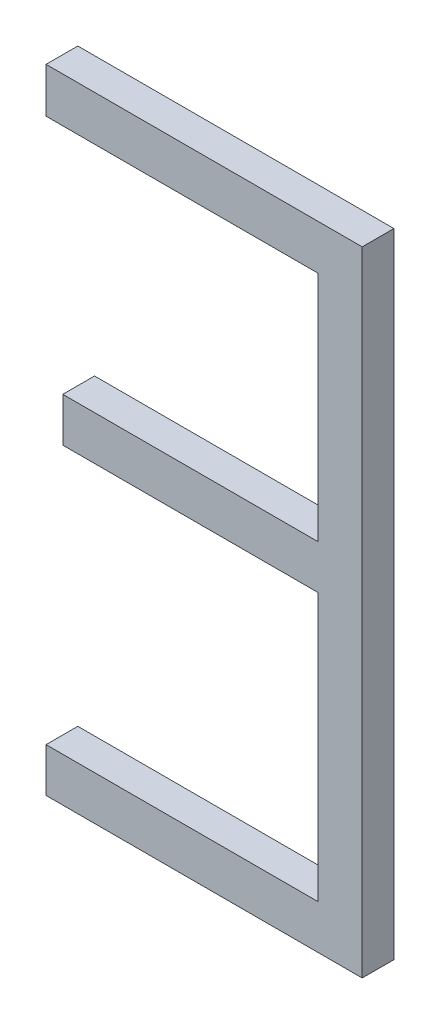
ISO-10303-21;
HEADER;
FILE_DESCRIPTION(('STEP AP214'),'2;1');
FILE_NAME('part.step','',(''),(''),'','','');
FILE_SCHEMA(('AUTOMOTIVE_DESIGN { 1 0 10303 214 1 1 1 1 }'));
ENDSEC;
DATA;
#1=APPLICATION_CONTEXT('core data for automotive mechanical design processes');
#2=APPLICATION_PROTOCOL_DEFINITION('international standard','automotive_design',2000,#1);
#3=PRODUCT_CONTEXT('',#1,'mechanical');
#4=PRODUCT('Part','Part','',(#3));
#5=PRODUCT_RELATED_PRODUCT_CATEGORY('part','',(#4));
#6=PRODUCT_DEFINITION_FORMATION('','',#4);
#7=PRODUCT_DEFINITION_CONTEXT('part definition',#1,'design');
#8=PRODUCT_DEFINITION('design','',#6,#7);
#9=PRODUCT_DEFINITION_SHAPE('','',#8);
#10=(LENGTH_UNIT() NAMED_UNIT(*) SI_UNIT(.MILLI.,.METRE.));
#11=(NAMED_UNIT(*) PLANE_ANGLE_UNIT() SI_UNIT($,.RADIAN.));
#12=(NAMED_UNIT(*) SI_UNIT($,.STERADIAN.) SOLID_ANGLE_UNIT());
#13=UNCERTAINTY_MEASURE_WITH_UNIT(LENGTH_MEASURE(1.E-05),#10,'distance_accuracy_value','');
#14=(GEOMETRIC_REPRESENTATION_CONTEXT(3) GLOBAL_UNCERTAINTY_ASSIGNED_CONTEXT((#13)) GLOBAL_UNIT_ASSIGNED_CONTEXT((#10,
#11,#12)) REPRESENTATION_CONTEXT('',''));
#15=CARTESIAN_POINT('',(0.,0.,0.));
#16=DIRECTION('',(0.,0.,1.));
#17=DIRECTION('',(1.,0.,0.));
#18=AXIS2_PLACEMENT_3D('',#15,#16,#17);
#19=CARTESIAN_POINT('',(68.6985059877903,65.7847250723611,-39.));
#20=DIRECTION('',(0.,0.,1.));
#21=DIRECTION('',(1.,0.,0.));
#22=AXIS2_PLACEMENT_3D('',#19,#20,#21);
#23=PLANE('',#22);
#24=DIRECTION('',(0.,1.,0.));
#25=VECTOR('',#24,1.);
#26=CARTESIAN_POINT('',(69.5556488448903,65.7847250723611,-39.));
#27=LINE('',#26,#25);
#28=CARTESIAN_POINT('',(69.5556488448903,66.7666945591811,-39.));
#29=VERTEX_POINT('',#28);
#30=CARTESIAN_POINT('',(69.5556488448903,65.9234213275611,-39.));
#31=VERTEX_POINT('',#30);
#32=EDGE_CURVE('E109',#29,#31,#27,.F.);
#33=ORIENTED_EDGE('',*,*,#32,.T.);
#34=DIRECTION('',(1.,0.,0.));
#35=VECTOR('',#34,1.);
#36=CARTESIAN_POINT('',(68.6985059877903,65.9234213275611,-39.));
#37=LINE('',#36,#35);
#38=CARTESIAN_POINT('',(68.6985059877903,65.9234213275611,-39.));
#39=VERTEX_POINT('',#38);
#40=EDGE_CURVE('E106',#31,#39,#37,.F.);
#41=ORIENTED_EDGE('',*,*,#40,.T.);
#42=DIRECTION('',(0.,1.,0.));
#43=VECTOR('',#42,1.);
#44=CARTESIAN_POINT('',(68.6985059877903,65.7847250723611,-39.));
#45=LINE('',#44,#43);
#46=CARTESIAN_POINT('',(68.6985059877903,65.7847250723611,-39.));
#47=VERTEX_POINT('',#46);
#48=EDGE_CURVE('E20',#39,#47,#45,.F.);
#49=ORIENTED_EDGE('',*,*,#48,.T.);
#50=DIRECTION('',(1.,0.,0.));
#51=VECTOR('',#50,1.);
#52=CARTESIAN_POINT('',(68.6985059877903,65.7847250723611,-39.));
#53=LINE('',#52,#51);
#54=CARTESIAN_POINT('',(69.6943451000903,65.7847250723611,-39.));
#55=VERTEX_POINT('',#54);
#56=EDGE_CURVE('E112',#47,#55,#53,.T.);
#57=ORIENTED_EDGE('',*,*,#56,.T.);
#58=DIRECTION('',(0.,1.,0.));
#59=VECTOR('',#58,1.);
#60=CARTESIAN_POINT('',(69.6943451000903,65.7847250723611,-39.));
#61=LINE('',#60,#59);
#62=CARTESIAN_POINT('',(69.6943451000903,67.7791772221511,-39.));
#63=VERTEX_POINT('',#62);
#64=EDGE_CURVE('E141',#55,#63,#61,.T.);
#65=ORIENTED_EDGE('',*,*,#64,.T.);
#66=DIRECTION('',(1.,0.,0.));
#67=VECTOR('',#66,1.);
#68=CARTESIAN_POINT('',(68.6985059877903,67.7791772221511,-39.));
#69=LINE('',#68,#67);
#70=CARTESIAN_POINT('',(68.6985059877903,67.7791772221511,-39.));
#71=VERTEX_POINT('',#70);
#72=EDGE_CURVE('E102',#63,#71,#69,.F.);
#73=ORIENTED_EDGE('',*,*,#72,.T.);
#74=DIRECTION('',(0.,1.,0.));
#75=VECTOR('',#74,1.);
#76=CARTESIAN_POINT('',(68.6985059877903,65.7847250723611,-39.));
#77=LINE('',#76,#75);
#78=CARTESIAN_POINT('',(68.6985059877903,67.6377070418411,-39.));
#79=VERTEX_POINT('',#78);
#80=EDGE_CURVE('E123',#71,#79,#77,.F.);
#81=ORIENTED_EDGE('',*,*,#80,.T.);
#82=DIRECTION('',(1.,0.,0.));
#83=VECTOR('',#82,1.);
#84=CARTESIAN_POINT('',(68.6985059877903,67.6377070418411,-39.));
#85=LINE('',#84,#83);
#86=CARTESIAN_POINT('',(69.5556488448903,67.6377070418411,-39.));
#87=VERTEX_POINT('',#86);
#88=EDGE_CURVE('E124',#79,#87,#85,.T.);
#89=ORIENTED_EDGE('',*,*,#88,.T.);
#90=DIRECTION('',(0.,1.,0.));
#91=VECTOR('',#90,1.);
#92=CARTESIAN_POINT('',(69.5556488448903,65.7847250723611,-39.));
#93=LINE('',#92,#91);
#94=CARTESIAN_POINT('',(69.5556488448903,66.9053908143811,-39.));
#95=VERTEX_POINT('',#94);
#96=EDGE_CURVE('E128',#87,#95,#93,.F.);
#97=ORIENTED_EDGE('',*,*,#96,.T.);
#98=DIRECTION('',(1.,0.,0.));
#99=VECTOR('',#98,1.);
#100=CARTESIAN_POINT('',(68.6985059877903,66.9053908143811,-39.));
#101=LINE('',#100,#99);
#102=CARTESIAN_POINT('',(68.7512105646903,66.9053908143811,-39.));
#103=VERTEX_POINT('',#102);
#104=EDGE_CURVE('E130',#95,#103,#101,.F.);
#105=ORIENTED_EDGE('',*,*,#104,.T.);
#106=DIRECTION('',(0.,1.,0.));
#107=VECTOR('',#106,1.);
#108=CARTESIAN_POINT('',(68.7512105646903,65.7847250723611,-39.));
#109=LINE('',#108,#107);
#110=CARTESIAN_POINT('',(68.7512105646903,66.7666945591811,-39.));
#111=VERTEX_POINT('',#110);
#112=EDGE_CURVE('E132',#103,#111,#109,.F.);
#113=ORIENTED_EDGE('',*,*,#112,.T.);
#114=DIRECTION('',(1.,0.,0.));
#115=VECTOR('',#114,1.);
#116=CARTESIAN_POINT('',(68.6985059877903,66.7666945591811,-39.));
#117=LINE('',#116,#115);
#118=EDGE_CURVE('E134',#111,#29,#117,.T.);
#119=ORIENTED_EDGE('',*,*,#118,.T.);
#120=EDGE_LOOP('',(#33,#41,#49,#57,#65,#73,#81,#89,#97,#105,#113,#119));
#121=FACE_BOUND('',#120,.T.);
#122=ADVANCED_FACE('F17',(#121),#23,.T.);
#123=CARTESIAN_POINT('',(68.6985059877903,65.7847250723611,-39.));
#124=DIRECTION('',(0.,1.,0.));
#125=DIRECTION('',(0.,0.,1.));
#126=AXIS2_PLACEMENT_3D('',#123,#124,#125);
#127=PLANE('',#126);
#128=DIRECTION('',(0.,0.,1.));
#129=VECTOR('',#128,1.);
#130=CARTESIAN_POINT('',(69.6943451000903,65.7847250723611,-39.));
#131=LINE('',#130,#129);
#132=CARTESIAN_POINT('',(69.6943451000903,65.7847250723611,-39.1));
#133=VERTEX_POINT('',#132);
#134=EDGE_CURVE('E138',#133,#55,#131,.T.);
#135=ORIENTED_EDGE('',*,*,#134,.T.);
#136=ORIENTED_EDGE('',*,*,#56,.F.);
#137=DIRECTION('',(0.,0.,-1.));
#138=VECTOR('',#137,1.);
#139=CARTESIAN_POINT('',(68.6985059877903,65.7847250723611,-39.));
#140=LINE('',#139,#138);
#141=CARTESIAN_POINT('',(68.6985059877903,65.7847250723611,-39.1));
#142=VERTEX_POINT('',#141);
#143=EDGE_CURVE('E117',#47,#142,#140,.T.);
#144=ORIENTED_EDGE('',*,*,#143,.T.);
#145=DIRECTION('',(1.,0.,0.));
#146=VECTOR('',#145,1.);
#147=CARTESIAN_POINT('',(68.6985059877903,65.7847250723611,-39.1));
#148=LINE('',#147,#146);
#149=EDGE_CURVE('E168',#142,#133,#148,.T.);
#150=ORIENTED_EDGE('',*,*,#149,.T.);
#151=EDGE_LOOP('',(#135,#136,#144,#150));
#152=FACE_BOUND('',#151,.T.);
#153=ADVANCED_FACE('F235',(#152),#127,.F.);
#154=CARTESIAN_POINT('',(69.6943451000903,65.7847250723611,-39.));
#155=DIRECTION('',(-1.,0.,0.));
#156=DIRECTION('',(0.,0.,1.));
#157=AXIS2_PLACEMENT_3D('',#154,#155,#156);
#158=PLANE('',#157);
#159=DIRECTION('',(0.,0.,-1.));
#160=VECTOR('',#159,1.);
#161=CARTESIAN_POINT('',(69.6943451000903,67.7791772221511,-39.));
#162=LINE('',#161,#160);
#163=CARTESIAN_POINT('',(69.6943451000903,67.7791772221511,-39.1));
#164=VERTEX_POINT('',#163);
#165=EDGE_CURVE('E143',#164,#63,#162,.F.);
#166=ORIENTED_EDGE('',*,*,#165,.T.);
#167=ORIENTED_EDGE('',*,*,#64,.F.);
#168=ORIENTED_EDGE('',*,*,#134,.F.);
#169=DIRECTION('',(0.,1.,0.));
#170=VECTOR('',#169,1.);
#171=CARTESIAN_POINT('',(69.6943451000903,65.7847250723611,-39.1));
#172=LINE('',#171,#170);
#173=EDGE_CURVE('E171',#133,#164,#172,.T.);
#174=ORIENTED_EDGE('',*,*,#173,.T.);
#175=EDGE_LOOP('',(#166,#167,#168,#174));
#176=FACE_BOUND('',#175,.T.);
#177=ADVANCED_FACE('F233',(#176),#158,.F.);
#178=CARTESIAN_POINT('',(69.6943451000903,67.7791772221511,-39.));
#179=DIRECTION('',(0.,-1.,0.));
#180=DIRECTION('',(0.,0.,-1.));
#181=AXIS2_PLACEMENT_3D('',#178,#179,#180);
#182=PLANE('',#181);
#183=DIRECTION('',(0.,0.,-1.));
#184=VECTOR('',#183,1.);
#185=CARTESIAN_POINT('',(68.6985059877903,67.7791772221511,-39.));
#186=LINE('',#185,#184);
#187=CARTESIAN_POINT('',(68.6985059877903,67.7791772221511,-39.1));
#188=VERTEX_POINT('',#187);
#189=EDGE_CURVE('E146',#188,#71,#186,.F.);
#190=ORIENTED_EDGE('',*,*,#189,.T.);
#191=ORIENTED_EDGE('',*,*,#72,.F.);
#192=ORIENTED_EDGE('',*,*,#165,.F.);
#193=DIRECTION('',(1.,0.,0.));
#194=VECTOR('',#193,1.);
#195=CARTESIAN_POINT('',(68.6985059877903,67.7791772221511,-39.1));
#196=LINE('',#195,#194);
#197=EDGE_CURVE('E174',#164,#188,#196,.F.);
#198=ORIENTED_EDGE('',*,*,#197,.T.);
#199=EDGE_LOOP('',(#190,#191,#192,#198));
#200=FACE_BOUND('',#199,.T.);
#201=ADVANCED_FACE('F230',(#200),#182,.F.);
#202=CARTESIAN_POINT('',(68.6985059877903,67.7791772221511,-39.));
#203=DIRECTION('',(1.,0.,0.));
#204=DIRECTION('',(0.,0.,-1.));
#205=AXIS2_PLACEMENT_3D('',#202,#203,#204);
#206=PLANE('',#205);
#207=DIRECTION('',(0.,0.,1.));
#208=VECTOR('',#207,1.);
#209=CARTESIAN_POINT('',(68.6985059877903,67.6377070418411,-39.));
#210=LINE('',#209,#208);
#211=CARTESIAN_POINT('',(68.6985059877903,67.6377070418411,-39.1));
#212=VERTEX_POINT('',#211);
#213=EDGE_CURVE('E148',#212,#79,#210,.T.);
#214=ORIENTED_EDGE('',*,*,#213,.T.);
#215=ORIENTED_EDGE('',*,*,#80,.F.);
#216=ORIENTED_EDGE('',*,*,#189,.F.);
#217=DIRECTION('',(0.,1.,0.));
#218=VECTOR('',#217,1.);
#219=CARTESIAN_POINT('',(68.6985059877903,65.7847250723611,-39.1));
#220=LINE('',#219,#218);
#221=EDGE_CURVE('E177',#188,#212,#220,.F.);
#222=ORIENTED_EDGE('',*,*,#221,.T.);
#223=EDGE_LOOP('',(#214,#215,#216,#222));
#224=FACE_BOUND('',#223,.T.);
#225=ADVANCED_FACE('F226',(#224),#206,.F.);
#226=CARTESIAN_POINT('',(68.6985059877903,67.6377070418411,-39.));
#227=DIRECTION('',(0.,1.,0.));
#228=DIRECTION('',(0.,0.,1.));
#229=AXIS2_PLACEMENT_3D('',#226,#227,#228);
#230=PLANE('',#229);
#231=DIRECTION('',(0.,0.,-1.));
#232=VECTOR('',#231,1.);
#233=CARTESIAN_POINT('',(69.5556488448903,67.6377070418411,-39.));
#234=LINE('',#233,#232);
#235=CARTESIAN_POINT('',(69.5556488448903,67.6377070418411,-39.1));
#236=VERTEX_POINT('',#235);
#237=EDGE_CURVE('E151',#236,#87,#234,.F.);
#238=ORIENTED_EDGE('',*,*,#237,.T.);
#239=ORIENTED_EDGE('',*,*,#88,.F.);
#240=ORIENTED_EDGE('',*,*,#213,.F.);
#241=DIRECTION('',(1.,0.,0.));
#242=VECTOR('',#241,1.);
#243=CARTESIAN_POINT('',(68.6985059877903,67.6377070418411,-39.1));
#244=LINE('',#243,#242);
#245=EDGE_CURVE('E180',#212,#236,#244,.T.);
#246=ORIENTED_EDGE('',*,*,#245,.T.);
#247=EDGE_LOOP('',(#238,#239,#240,#246));
#248=FACE_BOUND('',#247,.T.);
#249=ADVANCED_FACE('F222',(#248),#230,.F.);
#250=CARTESIAN_POINT('',(69.5556488448903,67.6377070418411,-39.));
#251=DIRECTION('',(1.,0.,0.));
#252=DIRECTION('',(0.,0.,-1.));
#253=AXIS2_PLACEMENT_3D('',#250,#251,#252);
#254=PLANE('',#253);
#255=DIRECTION('',(0.,0.,-1.));
#256=VECTOR('',#255,1.);
#257=CARTESIAN_POINT('',(69.5556488448903,66.9053908143811,-39.));
#258=LINE('',#257,#256);
#259=CARTESIAN_POINT('',(69.5556488448903,66.9053908143811,-39.1));
#260=VERTEX_POINT('',#259);
#261=EDGE_CURVE('E154',#260,#95,#258,.F.);
#262=ORIENTED_EDGE('',*,*,#261,.T.);
#263=ORIENTED_EDGE('',*,*,#96,.F.);
#264=ORIENTED_EDGE('',*,*,#237,.F.);
#265=DIRECTION('',(0.,1.,0.));
#266=VECTOR('',#265,1.);
#267=CARTESIAN_POINT('',(69.5556488448903,65.7847250723611,-39.1));
#268=LINE('',#267,#266);
#269=EDGE_CURVE('E183',#236,#260,#268,.F.);
#270=ORIENTED_EDGE('',*,*,#269,.T.);
#271=EDGE_LOOP('',(#262,#263,#264,#270));
#272=FACE_BOUND('',#271,.T.);
#273=ADVANCED_FACE('F218',(#272),#254,.F.);
#274=CARTESIAN_POINT('',(69.5556488448903,66.9053908143811,-39.));
#275=DIRECTION('',(0.,-1.,0.));
#276=DIRECTION('',(0.,0.,-1.));
#277=AXIS2_PLACEMENT_3D('',#274,#275,#276);
#278=PLANE('',#277);
#279=DIRECTION('',(0.,0.,-1.));
#280=VECTOR('',#279,1.);
#281=CARTESIAN_POINT('',(68.7512105646903,66.9053908143811,-39.));
#282=LINE('',#281,#280);
#283=CARTESIAN_POINT('',(68.7512105646903,66.9053908143811,-39.1));
#284=VERTEX_POINT('',#283);
#285=EDGE_CURVE('E157',#284,#103,#282,.F.);
#286=ORIENTED_EDGE('',*,*,#285,.T.);
#287=ORIENTED_EDGE('',*,*,#104,.F.);
#288=ORIENTED_EDGE('',*,*,#261,.F.);
#289=DIRECTION('',(1.,0.,0.));
#290=VECTOR('',#289,1.);
#291=CARTESIAN_POINT('',(68.6985059877903,66.9053908143811,-39.1));
#292=LINE('',#291,#290);
#293=EDGE_CURVE('E186',#260,#284,#292,.F.);
#294=ORIENTED_EDGE('',*,*,#293,.T.);
#295=EDGE_LOOP('',(#286,#287,#288,#294));
#296=FACE_BOUND('',#295,.T.);
#297=ADVANCED_FACE('F214',(#296),#278,.F.);
#298=CARTESIAN_POINT('',(68.7512105646903,66.9053908143811,-39.));
#299=DIRECTION('',(1.,0.,0.));
#300=DIRECTION('',(0.,0.,-1.));
#301=AXIS2_PLACEMENT_3D('',#298,#299,#300);
#302=PLANE('',#301);
#303=DIRECTION('',(0.,0.,1.));
#304=VECTOR('',#303,1.);
#305=CARTESIAN_POINT('',(68.7512105646903,66.7666945591811,-39.));
#306=LINE('',#305,#304);
#307=CARTESIAN_POINT('',(68.7512105646903,66.7666945591811,-39.1));
#308=VERTEX_POINT('',#307);
#309=EDGE_CURVE('E160',#308,#111,#306,.T.);
#310=ORIENTED_EDGE('',*,*,#309,.T.);
#311=ORIENTED_EDGE('',*,*,#112,.F.);
#312=ORIENTED_EDGE('',*,*,#285,.F.);
#313=DIRECTION('',(0.,1.,0.));
#314=VECTOR('',#313,1.);
#315=CARTESIAN_POINT('',(68.7512105646903,65.7847250723611,-39.1));
#316=LINE('',#315,#314);
#317=EDGE_CURVE('E189',#284,#308,#316,.F.);
#318=ORIENTED_EDGE('',*,*,#317,.T.);
#319=EDGE_LOOP('',(#310,#311,#312,#318));
#320=FACE_BOUND('',#319,.T.);
#321=ADVANCED_FACE('F210',(#320),#302,.F.);
#322=CARTESIAN_POINT('',(68.7512105646903,66.7666945591811,-39.));
#323=DIRECTION('',(0.,1.,0.));
#324=DIRECTION('',(0.,0.,1.));
#325=AXIS2_PLACEMENT_3D('',#322,#323,#324);
#326=PLANE('',#325);
#327=DIRECTION('',(0.,0.,-1.));
#328=VECTOR('',#327,1.);
#329=CARTESIAN_POINT('',(69.5556488448903,66.7666945591811,-39.));
#330=LINE('',#329,#328);
#331=CARTESIAN_POINT('',(69.5556488448903,66.7666945591811,-39.1));
#332=VERTEX_POINT('',#331);
#333=EDGE_CURVE('E163',#332,#29,#330,.F.);
#334=ORIENTED_EDGE('',*,*,#333,.T.);
#335=ORIENTED_EDGE('',*,*,#118,.F.);
#336=ORIENTED_EDGE('',*,*,#309,.F.);
#337=DIRECTION('',(1.,0.,0.));
#338=VECTOR('',#337,1.);
#339=CARTESIAN_POINT('',(68.6985059877903,66.7666945591811,-39.1));
#340=LINE('',#339,#338);
#341=EDGE_CURVE('E192',#308,#332,#340,.T.);
#342=ORIENTED_EDGE('',*,*,#341,.T.);
#343=EDGE_LOOP('',(#334,#335,#336,#342));
#344=FACE_BOUND('',#343,.T.);
#345=ADVANCED_FACE('F206',(#344),#326,.F.);
#346=CARTESIAN_POINT('',(69.5556488448903,66.7666945591811,-39.));
#347=DIRECTION('',(1.,0.,0.));
#348=DIRECTION('',(0.,0.,-1.));
#349=AXIS2_PLACEMENT_3D('',#346,#347,#348);
#350=PLANE('',#349);
#351=DIRECTION('',(0.,0.,-1.));
#352=VECTOR('',#351,1.);
#353=CARTESIAN_POINT('',(69.5556488448903,65.9234213275611,-39.));
#354=LINE('',#353,#352);
#355=CARTESIAN_POINT('',(69.5556488448903,65.9234213275611,-39.1));
#356=VERTEX_POINT('',#355);
#357=EDGE_CURVE('E118',#356,#31,#354,.F.);
#358=ORIENTED_EDGE('',*,*,#357,.T.);
#359=ORIENTED_EDGE('',*,*,#32,.F.);
#360=ORIENTED_EDGE('',*,*,#333,.F.);
#361=DIRECTION('',(0.,1.,0.));
#362=VECTOR('',#361,1.);
#363=CARTESIAN_POINT('',(69.5556488448903,65.7847250723611,-39.1));
#364=LINE('',#363,#362);
#365=EDGE_CURVE('E195',#332,#356,#364,.F.);
#366=ORIENTED_EDGE('',*,*,#365,.T.);
#367=EDGE_LOOP('',(#358,#359,#360,#366));
#368=FACE_BOUND('',#367,.T.);
#369=ADVANCED_FACE('F200',(#368),#350,.F.);
#370=CARTESIAN_POINT('',(69.5556488448903,65.9234213275611,-39.));
#371=DIRECTION('',(0.,-1.,0.));
#372=DIRECTION('',(0.,0.,-1.));
#373=AXIS2_PLACEMENT_3D('',#370,#371,#372);
#374=PLANE('',#373);
#375=DIRECTION('',(0.,0.,-1.));
#376=VECTOR('',#375,1.);
#377=CARTESIAN_POINT('',(68.6985059877903,65.9234213275611,-39.));
#378=LINE('',#377,#376);
#379=CARTESIAN_POINT('',(68.6985059877903,65.9234213275611,-39.1));
#380=VERTEX_POINT('',#379);
#381=EDGE_CURVE('E34',#380,#39,#378,.F.);
#382=ORIENTED_EDGE('',*,*,#381,.T.);
#383=ORIENTED_EDGE('',*,*,#40,.F.);
#384=ORIENTED_EDGE('',*,*,#357,.F.);
#385=DIRECTION('',(1.,0.,0.));
#386=VECTOR('',#385,1.);
#387=CARTESIAN_POINT('',(68.6985059877903,65.9234213275611,-39.1));
#388=LINE('',#387,#386);
#389=EDGE_CURVE('E26',#356,#380,#388,.F.);
#390=ORIENTED_EDGE('',*,*,#389,.T.);
#391=EDGE_LOOP('',(#382,#383,#384,#390));
#392=FACE_BOUND('',#391,.T.);
#393=ADVANCED_FACE('F115',(#392),#374,.F.);
#394=CARTESIAN_POINT('',(68.6985059877903,65.9234213275611,-39.));
#395=DIRECTION('',(1.,0.,0.));
#396=DIRECTION('',(0.,0.,-1.));
#397=AXIS2_PLACEMENT_3D('',#394,#395,#396);
#398=PLANE('',#397);
#399=ORIENTED_EDGE('',*,*,#143,.F.);
#400=ORIENTED_EDGE('',*,*,#48,.F.);
#401=ORIENTED_EDGE('',*,*,#381,.F.);
#402=DIRECTION('',(0.,1.,0.));
#403=VECTOR('',#402,1.);
#404=CARTESIAN_POINT('',(68.6985059877903,65.7847250723611,-39.1));
#405=LINE('',#404,#403);
#406=EDGE_CURVE('E11',#380,#142,#405,.F.);
#407=ORIENTED_EDGE('',*,*,#406,.T.);
#408=EDGE_LOOP('',(#399,#400,#401,#407));
#409=FACE_BOUND('',#408,.T.);
#410=ADVANCED_FACE('F121',(#409),#398,.F.);
#411=CARTESIAN_POINT('',(68.6985059877903,65.7847250723611,-39.1));
#412=DIRECTION('',(0.,0.,1.));
#413=DIRECTION('',(1.,0.,0.));
#414=AXIS2_PLACEMENT_3D('',#411,#412,#413);
#415=PLANE('',#414);
#416=ORIENTED_EDGE('',*,*,#389,.F.);
#417=ORIENTED_EDGE('',*,*,#365,.F.);
#418=ORIENTED_EDGE('',*,*,#341,.F.);
#419=ORIENTED_EDGE('',*,*,#317,.F.);
#420=ORIENTED_EDGE('',*,*,#293,.F.);
#421=ORIENTED_EDGE('',*,*,#269,.F.);
#422=ORIENTED_EDGE('',*,*,#245,.F.);
#423=ORIENTED_EDGE('',*,*,#221,.F.);
#424=ORIENTED_EDGE('',*,*,#197,.F.);
#425=ORIENTED_EDGE('',*,*,#173,.F.);
#426=ORIENTED_EDGE('',*,*,#149,.F.);
#427=ORIENTED_EDGE('',*,*,#406,.F.);
#428=EDGE_LOOP('',(#416,#417,#418,#419,#420,#421,#422,#423,#424,#425,#426,#427));
#429=FACE_BOUND('',#428,.T.);
#430=ADVANCED_FACE('F203',(#429),#415,.F.);
#431=CLOSED_SHELL('',(#122,#153,#177,#201,#225,#249,#273,#297,#321,#345,#369,#393,#410,#430));
#432=MANIFOLD_SOLID_BREP('B1',#431);
#433=ADVANCED_BREP_SHAPE_REPRESENTATION('',(#18,#432),#14);
#434=SHAPE_DEFINITION_REPRESENTATION(#9,#433);
ENDSEC;
END-ISO-10303-21;
